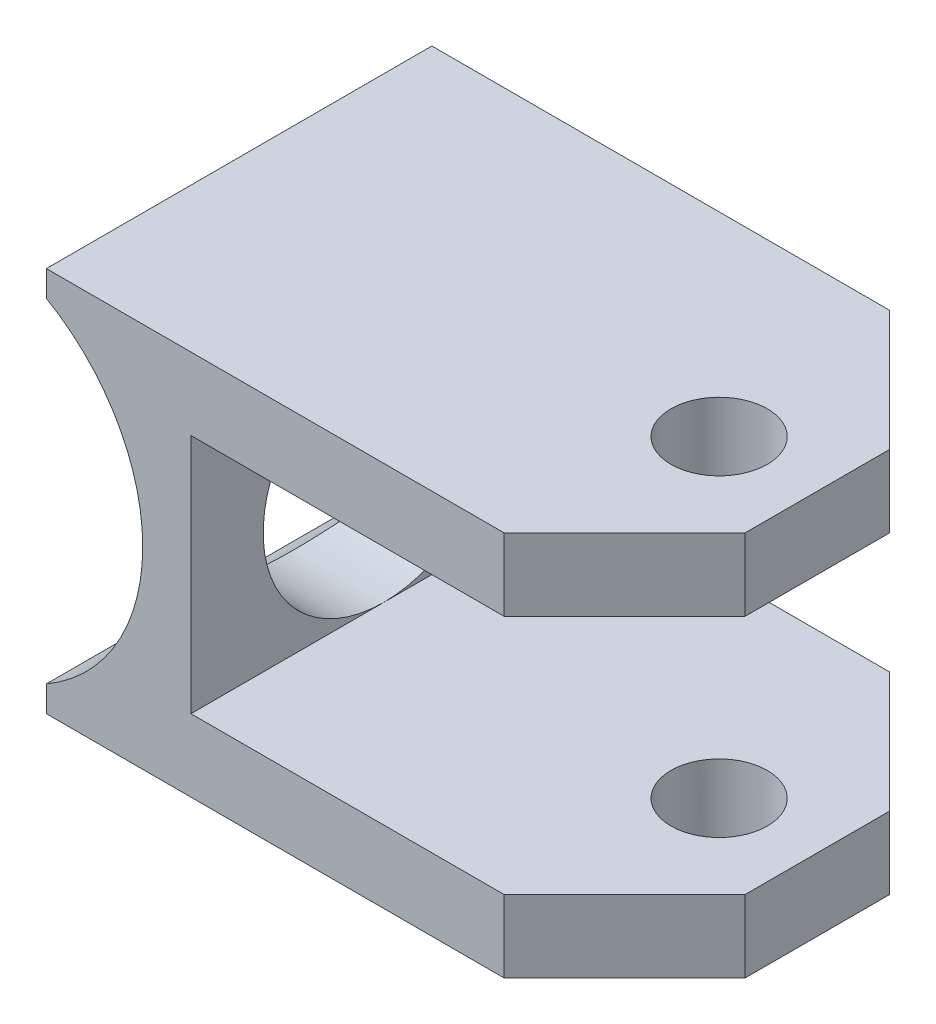
ISO-10303-21;
HEADER;
FILE_DESCRIPTION(('STEP AP214'),'2;1');
FILE_NAME('part.step','',(''),(''),'','','');
FILE_SCHEMA(('AUTOMOTIVE_DESIGN { 1 0 10303 214 1 1 1 1 }'));
ENDSEC;
DATA;
#1=APPLICATION_CONTEXT('core data for automotive mechanical design processes');
#2=APPLICATION_PROTOCOL_DEFINITION('international standard','automotive_design',2000,#1);
#3=PRODUCT_CONTEXT('',#1,'mechanical');
#4=PRODUCT('Part','Part','',(#3));
#5=PRODUCT_RELATED_PRODUCT_CATEGORY('part','',(#4));
#6=PRODUCT_DEFINITION_FORMATION('','',#4);
#7=PRODUCT_DEFINITION_CONTEXT('part definition',#1,'design');
#8=PRODUCT_DEFINITION('design','',#6,#7);
#9=PRODUCT_DEFINITION_SHAPE('','',#8);
#10=(LENGTH_UNIT() NAMED_UNIT(*) SI_UNIT(.MILLI.,.METRE.));
#11=(NAMED_UNIT(*) PLANE_ANGLE_UNIT() SI_UNIT($,.RADIAN.));
#12=(NAMED_UNIT(*) SI_UNIT($,.STERADIAN.) SOLID_ANGLE_UNIT());
#13=UNCERTAINTY_MEASURE_WITH_UNIT(LENGTH_MEASURE(1.E-05),#10,'distance_accuracy_value','');
#14=(GEOMETRIC_REPRESENTATION_CONTEXT(3) GLOBAL_UNCERTAINTY_ASSIGNED_CONTEXT((#13)) GLOBAL_UNIT_ASSIGNED_CONTEXT((#10,
#11,#12)) REPRESENTATION_CONTEXT('',''));
#15=CARTESIAN_POINT('',(0.,0.,0.));
#16=DIRECTION('',(0.,0.,1.));
#17=DIRECTION('',(1.,0.,0.));
#18=AXIS2_PLACEMENT_3D('',#15,#16,#17);
#19=CARTESIAN_POINT('',(15.875,7.9375,25.4));
#20=DIRECTION('',(-1.,0.,0.));
#21=DIRECTION('',(0.,-1.,0.));
#22=AXIS2_PLACEMENT_3D('',#19,#20,#21);
#23=PLANE('',#22);
#24=DIRECTION('',(0.,0.,-1.));
#25=VECTOR('',#24,1.);
#26=CARTESIAN_POINT('',(15.875,-7.9375,25.4));
#27=LINE('',#26,#25);
#28=CARTESIAN_POINT('',(15.875,-7.9375,25.4));
#29=VERTEX_POINT('',#28);
#30=CARTESIAN_POINT('',(15.875,-7.9375,12.7));
#31=VERTEX_POINT('',#30);
#32=EDGE_CURVE('E163',#29,#31,#27,.T.);
#33=ORIENTED_EDGE('',*,*,#32,.T.);
#34=CARTESIAN_POINT('',(15.875,0.,12.7));
#35=DIRECTION('',(1.,0.,0.));
#36=DIRECTION('',(0.,1.,0.));
#37=AXIS2_PLACEMENT_3D('',#34,#35,#36);
#38=CIRCLE('',#37,7.9375);
#39=CARTESIAN_POINT('',(15.875,7.9375,12.7));
#40=VERTEX_POINT('',#39);
#41=EDGE_CURVE('E56',#40,#31,#38,.T.);
#42=ORIENTED_EDGE('',*,*,#41,.F.);
#43=DIRECTION('',(0.,0.,-1.));
#44=VECTOR('',#43,1.);
#45=CARTESIAN_POINT('',(15.875,7.9375,25.4));
#46=LINE('',#45,#44);
#47=CARTESIAN_POINT('',(15.875,7.9375,25.4));
#48=VERTEX_POINT('',#47);
#49=EDGE_CURVE('E160',#48,#40,#46,.T.);
#50=ORIENTED_EDGE('',*,*,#49,.F.);
#51=DIRECTION('',(0.,1.,0.));
#52=VECTOR('',#51,1.);
#53=CARTESIAN_POINT('',(15.875,7.9375,25.4));
#54=LINE('',#53,#52);
#55=EDGE_CURVE('E231',#29,#48,#54,.T.);
#56=ORIENTED_EDGE('',*,*,#55,.F.);
#57=EDGE_LOOP('',(#33,#42,#50,#56));
#58=FACE_BOUND('',#57,.T.);
#59=ADVANCED_FACE('F36',(#58),#23,.F.);
#60=CARTESIAN_POINT('',(44.45,-7.9375,25.4));
#61=DIRECTION('',(0.,-1.,0.));
#62=DIRECTION('',(0.,0.,-1.));
#63=AXIS2_PLACEMENT_3D('',#60,#61,#62);
#64=PLANE('',#63);
#65=CARTESIAN_POINT('',(38.1,-7.9375,12.8217741924015));
#66=DIRECTION('',(0.,-1.,0.));
#67=DIRECTION('',(0.,0.,-1.));
#68=AXIS2_PLACEMENT_3D('',#65,#66,#67);
#69=CIRCLE('',#68,3.175);
#70=CARTESIAN_POINT('',(38.1,-7.9375,9.64677419240149));
#71=VERTEX_POINT('',#70);
#72=EDGE_CURVE('E244',#71,#71,#69,.T.);
#73=ORIENTED_EDGE('',*,*,#72,.T.);
#74=EDGE_LOOP('',(#73));
#75=FACE_BOUND('',#74,.T.);
#76=DIRECTION('',(0.,0.,-1.));
#77=VECTOR('',#76,1.);
#78=CARTESIAN_POINT('',(44.45,-7.9375,25.4));
#79=LINE('',#78,#77);
#80=CARTESIAN_POINT('',(44.45,-7.9375,17.4625));
#81=VERTEX_POINT('',#80);
#82=CARTESIAN_POINT('',(44.45,-7.9375,7.9375));
#83=VERTEX_POINT('',#82);
#84=EDGE_CURVE('E240',#81,#83,#79,.T.);
#85=ORIENTED_EDGE('',*,*,#84,.T.);
#86=DIRECTION('',(0.707106781186549,0.,0.707106781186546));
#87=VECTOR('',#86,1.);
#88=CARTESIAN_POINT('',(44.45,-7.9375,7.9375));
#89=LINE('',#88,#87);
#90=CARTESIAN_POINT('',(36.5125,-7.9375,0.));
#91=VERTEX_POINT('',#90);
#92=EDGE_CURVE('E206',#83,#91,#89,.F.);
#93=ORIENTED_EDGE('',*,*,#92,.T.);
#94=DIRECTION('',(-1.,0.,0.));
#95=VECTOR('',#94,1.);
#96=CARTESIAN_POINT('',(44.45,-7.9375,0.));
#97=LINE('',#96,#95);
#98=CARTESIAN_POINT('',(15.875,-7.9375,0.));
#99=VERTEX_POINT('',#98);
#100=EDGE_CURVE('E241',#91,#99,#97,.T.);
#101=ORIENTED_EDGE('',*,*,#100,.T.);
#102=EDGE_CURVE('E177',#31,#99,#27,.T.);
#103=ORIENTED_EDGE('',*,*,#102,.F.);
#104=ORIENTED_EDGE('',*,*,#32,.F.);
#105=DIRECTION('',(-1.,0.,0.));
#106=VECTOR('',#105,1.);
#107=CARTESIAN_POINT('',(44.45,-7.9375,25.4));
#108=LINE('',#107,#106);
#109=CARTESIAN_POINT('',(36.5125,-7.9375,25.4));
#110=VERTEX_POINT('',#109);
#111=EDGE_CURVE('E259',#110,#29,#108,.T.);
#112=ORIENTED_EDGE('',*,*,#111,.F.);
#113=DIRECTION('',(0.707106781186546,0.,-0.707106781186549));
#114=VECTOR('',#113,1.);
#115=CARTESIAN_POINT('',(36.5125,-7.9375,25.4));
#116=LINE('',#115,#114);
#117=EDGE_CURVE('E204',#110,#81,#116,.T.);
#118=ORIENTED_EDGE('',*,*,#117,.T.);
#119=EDGE_LOOP('',(#85,#93,#101,#103,#104,#112,#118));
#120=FACE_BOUND('',#119,.T.);
#121=ADVANCED_FACE('F319',(#75,#120),#64,.F.);
#122=CARTESIAN_POINT('',(15.875,7.9375,0.));
#123=VERTEX_POINT('',#122);
#124=EDGE_CURVE('E165',#40,#123,#46,.T.);
#125=ORIENTED_EDGE('',*,*,#124,.F.);
#126=EDGE_CURVE('E148',#31,#40,#38,.T.);
#127=ORIENTED_EDGE('',*,*,#126,.F.);
#128=ORIENTED_EDGE('',*,*,#102,.T.);
#129=DIRECTION('',(0.,1.,0.));
#130=VECTOR('',#129,1.);
#131=CARTESIAN_POINT('',(15.875,7.9375,0.));
#132=LINE('',#131,#130);
#133=EDGE_CURVE('E168',#99,#123,#132,.T.);
#134=ORIENTED_EDGE('',*,*,#133,.T.);
#135=EDGE_LOOP('',(#125,#127,#128,#134));
#136=FACE_BOUND('',#135,.T.);
#137=ADVANCED_FACE('F166',(#136),#23,.F.);
#138=CARTESIAN_POINT('',(44.45,7.9375,25.4));
#139=DIRECTION('',(0.,1.,0.));
#140=DIRECTION('',(0.,0.,1.));
#141=AXIS2_PLACEMENT_3D('',#138,#139,#140);
#142=PLANE('',#141);
#143=CARTESIAN_POINT('',(38.1,7.9375,12.8217741924015));
#144=DIRECTION('',(0.,1.,0.));
#145=DIRECTION('',(0.,0.,1.));
#146=AXIS2_PLACEMENT_3D('',#143,#144,#145);
#147=CIRCLE('',#146,3.175);
#148=CARTESIAN_POINT('',(38.1,7.9375,15.9967741924015));
#149=VERTEX_POINT('',#148);
#150=EDGE_CURVE('E355',#149,#149,#147,.T.);
#151=ORIENTED_EDGE('',*,*,#150,.T.);
#152=EDGE_LOOP('',(#151));
#153=FACE_BOUND('',#152,.T.);
#154=DIRECTION('',(1.,0.,0.));
#155=VECTOR('',#154,1.);
#156=CARTESIAN_POINT('',(44.45,7.9375,0.));
#157=LINE('',#156,#155);
#158=CARTESIAN_POINT('',(36.5125,7.9375,0.));
#159=VERTEX_POINT('',#158);
#160=EDGE_CURVE('E246',#123,#159,#157,.T.);
#161=ORIENTED_EDGE('',*,*,#160,.T.);
#162=DIRECTION('',(-0.707106781186549,0.,-0.707106781186546));
#163=VECTOR('',#162,1.);
#164=CARTESIAN_POINT('',(44.45,7.9375,7.9375));
#165=LINE('',#164,#163);
#166=CARTESIAN_POINT('',(44.45,7.9375,7.9375));
#167=VERTEX_POINT('',#166);
#168=EDGE_CURVE('E197',#159,#167,#165,.F.);
#169=ORIENTED_EDGE('',*,*,#168,.T.);
#170=DIRECTION('',(0.,0.,-1.));
#171=VECTOR('',#170,1.);
#172=CARTESIAN_POINT('',(44.45,7.9375,25.4));
#173=LINE('',#172,#171);
#174=CARTESIAN_POINT('',(44.45,7.9375,17.4625));
#175=VERTEX_POINT('',#174);
#176=EDGE_CURVE('E172',#175,#167,#173,.T.);
#177=ORIENTED_EDGE('',*,*,#176,.F.);
#178=DIRECTION('',(-0.707106781186546,0.,0.707106781186549));
#179=VECTOR('',#178,1.);
#180=CARTESIAN_POINT('',(36.5125,7.9375,25.4));
#181=LINE('',#180,#179);
#182=CARTESIAN_POINT('',(36.5125,7.9375,25.4));
#183=VERTEX_POINT('',#182);
#184=EDGE_CURVE('E195',#175,#183,#181,.T.);
#185=ORIENTED_EDGE('',*,*,#184,.T.);
#186=DIRECTION('',(1.,0.,0.));
#187=VECTOR('',#186,1.);
#188=CARTESIAN_POINT('',(44.45,7.9375,25.4));
#189=LINE('',#188,#187);
#190=EDGE_CURVE('E176',#48,#183,#189,.T.);
#191=ORIENTED_EDGE('',*,*,#190,.F.);
#192=ORIENTED_EDGE('',*,*,#49,.T.);
#193=ORIENTED_EDGE('',*,*,#124,.T.);
#194=EDGE_LOOP('',(#161,#169,#177,#185,#191,#192,#193));
#195=FACE_BOUND('',#194,.T.);
#196=ADVANCED_FACE('F174',(#153,#195),#142,.F.);
#197=CARTESIAN_POINT('',(44.45,12.7,25.4));
#198=DIRECTION('',(-1.,0.,0.));
#199=DIRECTION('',(0.,0.,1.));
#200=AXIS2_PLACEMENT_3D('',#197,#198,#199);
#201=PLANE('',#200);
#202=ORIENTED_EDGE('',*,*,#176,.T.);
#203=DIRECTION('',(0.,1.,0.));
#204=VECTOR('',#203,1.);
#205=CARTESIAN_POINT('',(44.45,12.7,7.9375));
#206=LINE('',#205,#204);
#207=CARTESIAN_POINT('',(44.45,12.7,7.9375));
#208=VERTEX_POINT('',#207);
#209=EDGE_CURVE('E184',#167,#208,#206,.T.);
#210=ORIENTED_EDGE('',*,*,#209,.T.);
#211=DIRECTION('',(0.,0.,-1.));
#212=VECTOR('',#211,1.);
#213=CARTESIAN_POINT('',(44.45,12.7,25.4));
#214=LINE('',#213,#212);
#215=CARTESIAN_POINT('',(44.45,12.7,17.4625));
#216=VERTEX_POINT('',#215);
#217=EDGE_CURVE('E274',#216,#208,#214,.T.);
#218=ORIENTED_EDGE('',*,*,#217,.F.);
#219=DIRECTION('',(0.,-1.,0.));
#220=VECTOR('',#219,1.);
#221=CARTESIAN_POINT('',(44.45,7.9375,17.4625));
#222=LINE('',#221,#220);
#223=EDGE_CURVE('E182',#216,#175,#222,.T.);
#224=ORIENTED_EDGE('',*,*,#223,.T.);
#225=EDGE_LOOP('',(#202,#210,#218,#224));
#226=FACE_BOUND('',#225,.T.);
#227=ADVANCED_FACE('F279',(#226),#201,.F.);
#228=CARTESIAN_POINT('',(6.35,12.7,25.4));
#229=DIRECTION('',(0.,-1.,0.));
#230=DIRECTION('',(0.,0.,-1.));
#231=AXIS2_PLACEMENT_3D('',#228,#229,#230);
#232=PLANE('',#231);
#233=CARTESIAN_POINT('',(38.1,12.7,12.8217741924015));
#234=DIRECTION('',(0.,1.,0.));
#235=DIRECTION('',(0.,0.,1.));
#236=AXIS2_PLACEMENT_3D('',#233,#234,#235);
#237=CIRCLE('',#236,3.175);
#238=CARTESIAN_POINT('',(38.1,12.7,15.9967741924015));
#239=VERTEX_POINT('',#238);
#240=EDGE_CURVE('E349',#239,#239,#237,.T.);
#241=ORIENTED_EDGE('',*,*,#240,.F.);
#242=EDGE_LOOP('',(#241));
#243=FACE_BOUND('',#242,.T.);
#244=ORIENTED_EDGE('',*,*,#217,.T.);
#245=DIRECTION('',(0.707106781186549,0.,0.707106781186546));
#246=VECTOR('',#245,1.);
#247=CARTESIAN_POINT('',(44.45,12.7,7.9375));
#248=LINE('',#247,#246);
#249=CARTESIAN_POINT('',(36.5125,12.7,0.));
#250=VERTEX_POINT('',#249);
#251=EDGE_CURVE('E189',#208,#250,#248,.F.);
#252=ORIENTED_EDGE('',*,*,#251,.T.);
#253=DIRECTION('',(-1.,0.,0.));
#254=VECTOR('',#253,1.);
#255=CARTESIAN_POINT('',(6.35,12.7,0.));
#256=LINE('',#255,#254);
#257=CARTESIAN_POINT('',(6.35,12.7,0.));
#258=VERTEX_POINT('',#257);
#259=EDGE_CURVE('E248',#250,#258,#256,.T.);
#260=ORIENTED_EDGE('',*,*,#259,.T.);
#261=DIRECTION('',(0.,0.,-1.));
#262=VECTOR('',#261,1.);
#263=CARTESIAN_POINT('',(6.35,12.7,25.4));
#264=LINE('',#263,#262);
#265=CARTESIAN_POINT('',(6.35,12.7,25.4));
#266=VERTEX_POINT('',#265);
#267=EDGE_CURVE('E225',#266,#258,#264,.T.);
#268=ORIENTED_EDGE('',*,*,#267,.F.);
#269=DIRECTION('',(-1.,0.,0.));
#270=VECTOR('',#269,1.);
#271=CARTESIAN_POINT('',(6.35,12.7,25.4));
#272=LINE('',#271,#270);
#273=CARTESIAN_POINT('',(36.5125,12.7,25.4));
#274=VERTEX_POINT('',#273);
#275=EDGE_CURVE('E216',#274,#266,#272,.T.);
#276=ORIENTED_EDGE('',*,*,#275,.F.);
#277=DIRECTION('',(0.707106781186546,0.,-0.707106781186549));
#278=VECTOR('',#277,1.);
#279=CARTESIAN_POINT('',(36.5125,12.7,25.4));
#280=LINE('',#279,#278);
#281=EDGE_CURVE('E187',#274,#216,#280,.T.);
#282=ORIENTED_EDGE('',*,*,#281,.T.);
#283=EDGE_LOOP('',(#244,#252,#260,#268,#276,#282));
#284=FACE_BOUND('',#283,.T.);
#285=ADVANCED_FACE('F222',(#243,#284),#232,.F.);
#286=CARTESIAN_POINT('',(6.35,12.7,25.4));
#287=DIRECTION('',(1.,0.,0.));
#288=DIRECTION('',(0.,0.,-1.));
#289=AXIS2_PLACEMENT_3D('',#286,#287,#288);
#290=PLANE('',#289);
#291=DIRECTION('',(0.,-1.,0.));
#292=VECTOR('',#291,1.);
#293=CARTESIAN_POINT('',(6.35,12.7,0.));
#294=LINE('',#293,#292);
#295=CARTESIAN_POINT('',(6.35,10.9985226280624,0.));
#296=VERTEX_POINT('',#295);
#297=EDGE_CURVE('E250',#258,#296,#294,.T.);
#298=ORIENTED_EDGE('',*,*,#297,.T.);
#299=DIRECTION('',(0.,0.,-1.));
#300=VECTOR('',#299,1.);
#301=CARTESIAN_POINT('',(6.35,10.9985226280624,25.4));
#302=LINE('',#301,#300);
#303=CARTESIAN_POINT('',(6.35,10.9985226280624,25.4));
#304=VERTEX_POINT('',#303);
#305=EDGE_CURVE('E271',#304,#296,#302,.T.);
#306=ORIENTED_EDGE('',*,*,#305,.F.);
#307=DIRECTION('',(0.,-1.,0.));
#308=VECTOR('',#307,1.);
#309=CARTESIAN_POINT('',(6.35,12.7,25.4));
#310=LINE('',#309,#308);
#311=EDGE_CURVE('E227',#266,#304,#310,.T.);
#312=ORIENTED_EDGE('',*,*,#311,.F.);
#313=ORIENTED_EDGE('',*,*,#267,.T.);
#314=EDGE_LOOP('',(#298,#306,#312,#313));
#315=FACE_BOUND('',#314,.T.);
#316=ADVANCED_FACE('F293',(#315),#290,.F.);
#317=CARTESIAN_POINT('',(0.,0.,25.4));
#318=DIRECTION('',(0.,0.,-1.));
#319=DIRECTION('',(-1.,0.,0.));
#320=AXIS2_PLACEMENT_3D('',#317,#318,#319);
#321=CYLINDRICAL_SURFACE('',#320,12.7);
#322=CARTESIAN_POINT('',(9.91393432245746,7.93749999999999,12.7));
#323=CARTESIAN_POINT('',(9.91393743092308,7.93749807117173,12.8973419473668));
#324=CARTESIAN_POINT('',(9.91985215824847,7.93012603335574,13.0947215209105));
#325=CARTESIAN_POINT('',(9.94324673536641,7.90077104762888,13.4877854127054));
#326=CARTESIAN_POINT('',(9.96073339680289,7.87877949412646,13.6834686636694));
#327=CARTESIAN_POINT('',(10.0065324338063,7.82052925594829,14.0718083760823));
#328=CARTESIAN_POINT('',(10.0348666437677,7.78424179156469,14.2644579115298));
#329=CARTESIAN_POINT('',(10.101195001923,7.69797450385109,14.645043990796));
#330=CARTESIAN_POINT('',(10.1391939786885,7.64798783535172,14.8329781270604));
#331=CARTESIAN_POINT('',(10.2230420608463,7.53553428680958,15.2012730518735));
#332=CARTESIAN_POINT('',(10.2688158617562,7.47318624722427,15.3816875444356));
#333=CARTESIAN_POINT('',(10.3670018650817,7.33637238040691,15.7360566142668));
#334=CARTESIAN_POINT('',(10.4194165927314,7.26190194050868,15.9100087014738));
#335=CARTESIAN_POINT('',(10.5293900056247,7.10150650275365,16.2507695742633));
#336=CARTESIAN_POINT('',(10.5869470535524,7.01558514661686,16.4175806087131));
#337=CARTESIAN_POINT('',(10.7058168021436,6.8328157497932,16.7436961942778));
#338=CARTESIAN_POINT('',(10.7671296214479,6.7359673638515,16.9030005079817));
#339=CARTESIAN_POINT('',(10.9005856580608,6.51810262210699,17.2346122324182));
#340=CARTESIAN_POINT('',(10.9730780959916,6.39558712833621,17.4057956613673));
#341=CARTESIAN_POINT('',(11.1193961406205,6.13767190932958,17.7375632510214));
#342=CARTESIAN_POINT('',(11.1932218447478,6.00227123938997,17.8981466330976));
#343=CARTESIAN_POINT('',(11.3405793525838,5.71898311367739,18.2082916826293));
#344=CARTESIAN_POINT('',(11.4141108977764,5.57108647346249,18.3578450892493));
#345=CARTESIAN_POINT('',(11.5592442814053,5.26334714419427,18.6452007689191));
#346=CARTESIAN_POINT('',(11.6308457432919,5.10350214670036,18.7830007601235));
#347=CARTESIAN_POINT('',(11.7790512355257,4.75231816673879,19.062041829267));
#348=CARTESIAN_POINT('',(11.8552106939563,4.55950961778765,19.2016779504539));
#349=CARTESIAN_POINT('',(12.0010624927184,4.16048061480433,19.4639692392614));
#350=CARTESIAN_POINT('',(12.0707577505083,3.9542662833262,19.586632079773));
#351=CARTESIAN_POINT('',(12.2017054249088,3.52955168731285,19.8136569756096));
#352=CARTESIAN_POINT('',(12.2629618345875,3.31105730280366,19.918027692753));
#353=CARTESIAN_POINT('',(12.3751940579834,2.86318550306455,20.1070996839522));
#354=CARTESIAN_POINT('',(12.4261717410597,2.63381007612534,20.1918045350015));
#355=CARTESIAN_POINT('',(12.5116072321274,2.18985682334513,20.3326287607597));
#356=CARTESIAN_POINT('',(12.5472173985435,1.97614412570738,20.3907783430431));
#357=CARTESIAN_POINT('',(12.6077929385108,1.54315338166047,20.4892142298474));
#358=CARTESIAN_POINT('',(12.632758967362,1.32387567873837,20.5295016340485));
#359=CARTESIAN_POINT('',(12.6712823156172,0.881910980169238,20.5915075654516));
#360=CARTESIAN_POINT('',(12.6848496264323,0.659227144852406,20.6132423549958));
#361=CARTESIAN_POINT('',(12.700189771581,0.212423453759177,20.637809668065));
#362=CARTESIAN_POINT('',(12.7019639634905,-0.011696233754465,20.6406443672919));
#363=CARTESIAN_POINT('',(12.6942296634621,-0.429035223888257,20.6282648350536));
#364=CARTESIAN_POINT('',(12.6862058663109,-0.62235823312776,20.6154257355186));
#365=CARTESIAN_POINT('',(12.6614801835746,-1.00700112464608,20.575736763912));
#366=CARTESIAN_POINT('',(12.6447783901897,-1.19832102818506,20.5488870406977));
#367=CARTESIAN_POINT('',(12.6030772135313,-1.57760898199506,20.4815268240343));
#368=CARTESIAN_POINT('',(12.5780779198634,-1.76557706843963,20.4410164781077));
#369=CARTESIAN_POINT('',(12.5203318918918,-2.13696376055922,20.3468293775869));
#370=CARTESIAN_POINT('',(12.4875848313309,-2.32038217428876,20.2931520685303));
#371=CARTESIAN_POINT('',(12.4149421348142,-2.68203232637647,20.1730841675945));
#372=CARTESIAN_POINT('',(12.3750303286643,-2.86025124976266,20.1066647942266));
#373=CARTESIAN_POINT('',(12.288903070966,-3.21020089927347,19.9618469139278));
#374=CARTESIAN_POINT('',(12.2426855288447,-3.3819294493971,19.8834444331348));
#375=CARTESIAN_POINT('',(12.095872474436,-3.88614684054671,19.6312926139097));
#376=CARTESIAN_POINT('',(11.9870644777299,-4.20791741807511,19.4405148403145));
#377=CARTESIAN_POINT('',(11.7407146973701,-4.8559779367887,18.9926593049406));
#378=CARTESIAN_POINT('',(11.6012821960077,-5.1778470367181,18.7302852986395));
#379=CARTESIAN_POINT('',(11.3153894233701,-5.77597246713827,18.160122153886));
#380=CARTESIAN_POINT('',(11.1689191509646,-6.05216125105313,17.85226701367));
#381=CARTESIAN_POINT('',(10.9442052242841,-6.44525099752128,17.3386711320003));
#382=CARTESIAN_POINT('',(10.863953416429,-6.57924242421982,17.1466373385129));
#383=CARTESIAN_POINT('',(10.7077668255894,-6.83048858697236,16.7501114043343));
#384=CARTESIAN_POINT('',(10.6318328552849,-6.94774017857745,16.5456169332671));
#385=CARTESIAN_POINT('',(10.4871369448416,-7.16428003695993,16.1253190811957));
#386=CARTESIAN_POINT('',(10.4183644230893,-7.26359497075574,15.9095331140881));
#387=CARTESIAN_POINT('',(10.2907680692678,-7.4432684407942,15.4674053699895));
#388=CARTESIAN_POINT('',(10.2319399940845,-7.52363506774175,15.2410681478863));
#389=CARTESIAN_POINT('',(10.1409356021058,-7.64562571774624,14.840082345974));
#390=CARTESIAN_POINT('',(10.1058190992332,-7.69188004525148,14.6674974829339));
#391=CARTESIAN_POINT('',(10.0436676197095,-7.77286000991658,14.3182297843453));
#392=CARTESIAN_POINT('',(10.0166306889123,-7.80758843498593,14.1415479508588));
#393=CARTESIAN_POINT('',(9.97159914754477,-7.86502040955978,13.7852993043909));
#394=CARTESIAN_POINT('',(9.9535943493274,-7.88773750861337,13.6057359786318));
#395=CARTESIAN_POINT('',(9.92725853225642,-7.92085789749513,13.2447592078086));
#396=CARTESIAN_POINT('',(9.91892766668002,-7.93126099221591,13.0633457334762));
#397=CARTESIAN_POINT('',(9.91226303596064,-7.93958886915166,12.699627886823));
#398=CARTESIAN_POINT('',(9.91395234775775,-7.93748484686335,12.5173224248947));
#399=CARTESIAN_POINT('',(9.92731384781059,-7.92076713027602,12.1536582134984));
#400=CARTESIAN_POINT('',(9.93898609289779,-7.90615336476078,11.9722994694258));
#401=CARTESIAN_POINT('',(9.97186350946095,-7.86464458928345,11.6117828822214));
#402=CARTESIAN_POINT('',(9.99307362080675,-7.83774321518591,11.4326262290601));
#403=CARTESIAN_POINT('',(10.0442534502941,-7.77204614469582,11.0777196131951));
#404=CARTESIAN_POINT('',(10.0742267851106,-7.73324553703941,10.9019710890601));
#405=CARTESIAN_POINT('',(10.1413407941711,-7.64501277058946,10.5578759134273));
#406=CARTESIAN_POINT('',(10.1783507843565,-7.59577281991966,10.3894541906629));
#407=CARTESIAN_POINT('',(10.2587766080083,-7.48679406868883,10.0575869903785));
#408=CARTESIAN_POINT('',(10.3021945286435,-7.42705184614786,9.89414315524309));
#409=CARTESIAN_POINT('',(10.4403538304839,-7.23285940874745,9.41220711452345));
#410=CARTESIAN_POINT('',(10.5430357226203,-7.08339933513072,9.10194110865951));
#411=CARTESIAN_POINT('',(10.781510951545,-6.71606056449941,8.4498234680742));
#412=CARTESIAN_POINT('',(10.9198863364876,-6.49057334557518,8.11320473830511));
#413=CARTESIAN_POINT('',(11.1306963245213,-6.11704111107704,7.63774622437057));
#414=CARTESIAN_POINT('',(11.2015652952635,-5.98652858081219,7.48406086270945));
#415=CARTESIAN_POINT('',(11.3429763006025,-5.71405449107206,7.18691398237368));
#416=CARTESIAN_POINT('',(11.4135182725577,-5.57209082661585,7.04345435259447));
#417=CARTESIAN_POINT('',(11.5640372459169,-5.2534636765396,6.74516975727459));
#418=CARTESIAN_POINT('',(11.6437082552696,-5.07489047419139,6.59222444225079));
#419=CARTESIAN_POINT('',(11.7985367210445,-4.70371630182141,6.30199791161703));
#420=CARTESIAN_POINT('',(11.8736958712464,-4.51112065675944,6.16471080018115));
#421=CARTESIAN_POINT('',(12.0175099931568,-4.11269997828182,5.90692310882832));
#422=CARTESIAN_POINT('',(12.0861652819097,-3.9068755905506,5.78642171052195));
#423=CARTESIAN_POINT('',(12.215028128029,-3.48311756629154,5.56353821312848));
#424=CARTESIAN_POINT('',(12.2752367509349,-3.26518546199252,5.46115382816924));
#425=CARTESIAN_POINT('',(12.3821073364553,-2.83199177980674,5.28141588628359));
#426=CARTESIAN_POINT('',(12.4293629720927,-2.61734576396781,5.20293385002475));
#427=CARTESIAN_POINT('',(12.5134440839727,-2.18019278875926,5.06434501873419));
#428=CARTESIAN_POINT('',(12.5502698053864,-1.95768601430726,5.00423779177151));
#429=CARTESIAN_POINT('',(12.6123219175109,-1.50698970812904,4.90345291578128));
#430=CARTESIAN_POINT('',(12.6375616318848,-1.27880702366645,4.86275294671762));
#431=CARTESIAN_POINT('',(12.6756810572711,-0.818749786145594,4.80143183963765));
#432=CARTESIAN_POINT('',(12.688562812949,-0.586875850273308,4.78080738005311));
#433=CARTESIAN_POINT('',(12.7005867596475,-0.156261293647302,4.76155892461821));
#434=CARTESIAN_POINT('',(12.70147806193,0.0423118825154984,4.76013411291166));
#435=CARTESIAN_POINT('',(12.6939644931375,0.438829919383832,4.77215881998338));
#436=CARTESIAN_POINT('',(12.685560050359,0.636774808615952,4.78560765346638));
#437=CARTESIAN_POINT('',(12.6596609571081,1.03049004439692,4.82718699179976));
#438=CARTESIAN_POINT('',(12.6421670478776,1.22626056693495,4.85531629946479));
#439=CARTESIAN_POINT('',(12.598507705164,1.61422143641658,4.92587174223497));
#440=CARTESIAN_POINT('',(12.5723420911155,1.80641170872293,4.96829817504016));
#441=CARTESIAN_POINT('',(12.5129997291544,2.17927146967088,5.06517973090754));
#442=CARTESIAN_POINT('',(12.4801004774043,2.36010874093628,5.11916178651719));
#443=CARTESIAN_POINT('',(12.4074472588691,2.71630413457792,5.23937361310624));
#444=CARTESIAN_POINT('',(12.3676910756804,2.89166046360292,5.30560734476566));
#445=CARTESIAN_POINT('',(12.2821039617717,3.23594956191219,5.4496659460595));
#446=CARTESIAN_POINT('',(12.2362747015826,3.40488408126802,5.52748762890358));
#447=CARTESIAN_POINT('',(12.1393647800458,3.73571812716443,5.69409831573719));
#448=CARTESIAN_POINT('',(12.0882822147684,3.89761507265321,5.78289129836725));
#449=CARTESIAN_POINT('',(11.9174367352839,4.40453137082998,6.08422041738119));
#450=CARTESIAN_POINT('',(11.789125336336,4.73498961253622,6.3168741254543));
#451=CARTESIAN_POINT('',(11.5210034521921,5.35450474789467,6.82679162091428));
#452=CARTESIAN_POINT('',(11.38118007982,5.64351422152492,7.10410574499164));
#453=CARTESIAN_POINT('',(11.1609311335306,6.06245469084998,7.57138443198061));
#454=CARTESIAN_POINT('',(11.0806664160962,6.20757371147303,7.74801049072365));
#455=CARTESIAN_POINT('',(10.9221411305204,6.48244047607236,8.11368961161338));
#456=CARTESIAN_POINT('',(10.8438809280521,6.61218543087358,8.3027449190405));
#457=CARTESIAN_POINT('',(10.6156799834555,6.97705598554874,8.88746806028404));
#458=CARTESIAN_POINT('',(10.4720667600113,7.18827539875168,9.30120253140835));
#459=CARTESIAN_POINT('',(10.2507773072005,7.49932946637276,10.0737985118251));
#460=CARTESIAN_POINT('',(10.1655461083059,7.61344381460759,10.4247206322575));
#461=CARTESIAN_POINT('',(10.0631440576819,7.74765800298494,10.9644717705398));
#462=CARTESIAN_POINT('',(10.0332681346926,7.78621624163261,11.1464271212424));
#463=CARTESIAN_POINT('',(9.98298925565334,7.85058138682066,11.5138311056077));
#464=CARTESIAN_POINT('',(9.96258142541109,7.87639485483383,11.6992778905913));
#465=CARTESIAN_POINT('',(9.93626716627901,7.90954454493815,12.0207163673922));
#466=CARTESIAN_POINT('',(9.9279108380348,7.92001686347467,12.1561965252872));
#467=CARTESIAN_POINT('',(9.91674264691122,7.9339961320438,12.427778389774));
#468=CARTESIAN_POINT('',(9.91393217834371,7.93750133044005,12.5638802440509));
#469=CARTESIAN_POINT('',(9.91393432245746,7.93749999999999,12.7));
#470=B_SPLINE_CURVE_WITH_KNOTS('',3,(#322,#323,#324,#325,#326,#327,#328,#329,#330,#331,#332,
#333,#334,#335,#336,#337,#338,#339,#340,#341,#342,#343,#344,#345,#346,#347,#348,#349,#350,#351,
#352,#353,#354,#355,#356,#357,#358,#359,#360,#361,#362,#363,#364,#365,#366,#367,#368,#369,#370,
#371,#372,#373,#374,#375,#376,#377,#378,#379,#380,#381,#382,#383,#384,#385,#386,#387,#388,#389,
#390,#391,#392,#393,#394,#395,#396,#397,#398,#399,#400,#401,#402,#403,#404,#405,#406,#407,#408,
#409,#410,#411,#412,#413,#414,#415,#416,#417,#418,#419,#420,#421,#422,#423,#424,#425,#426,#427,
#428,#429,#430,#431,#432,#433,#434,#435,#436,#437,#438,#439,#440,#441,#442,#443,#444,#445,#446,
#447,#448,#449,#450,#451,#452,#453,#454,#455,#456,#457,#458,#459,#460,#461,#462,#463,#464,#465,
#466,#467,#468,#469),.UNSPECIFIED.,.T.,.F.,(4,2,2,2,2,2,2,2,2,2,2,2,2,2,2,2,2,2,2,2,2,2,2,2,2,2,
2,2,2,2,2,2,2,2,2,2,2,2,2,2,2,2,2,2,2,2,2,2,2,2,2,2,2,2,2,2,2,2,2,2,2,2,2,2,2,2,2,2,2,2,2,2,2,
4),(0.,0.591868627851358,1.18408596048253,1.77750165380366,2.37121440529117,2.95947423182983,
3.54795842122594,4.13625590039149,4.72457197284976,5.39183974714808,6.05915648133166,
6.72696802742672,7.39490893086401,8.14375547254982,8.89226237916849,9.64041388408815,
10.3884292021125,11.06042681852,11.7323830578222,12.4037496855178,13.0750390268694,
13.6560853409466,14.2371254817675,14.8181593480741,15.3992176859833,15.9816042967208,
16.5641844604029,17.7285465780936,19.0378098157476,20.3489920539132,21.090817692213,
21.8327824939127,22.5736349446533,23.3141704848642,23.8599197831255,24.405536978029,
24.9505373613146,25.4955463796607,26.0418110660364,26.5880788622416,27.134629908943,
27.68140684223,28.2188767470207,28.7565221025905,29.8312827257654,31.1106653030828,
31.7513794571451,32.392211658741,33.1360493525192,33.8796060359229,34.6231264544351,
35.3665529939868,36.0656523145943,36.7647352004268,37.4630121292216,38.1611735058357,
38.7561604440118,39.3511199696233,39.9460309841615,40.5409543869227,41.1150518645325,
41.6893352598014,42.2634610126861,42.8377955814166,44.1046058539166,45.3728540698994,
46.0989299661152,46.8251373865625,48.2753879889853,49.4067352744844,49.9712745352798,
50.5355228468086,50.9436710721342,51.3519218989456),.UNSPECIFIED.);
#471=CARTESIAN_POINT('',(9.91393432245746,7.93749999999999,12.7));
#472=VERTEX_POINT('',#471);
#473=EDGE_CURVE('E40',#472,#472,#470,.T.);
#474=ORIENTED_EDGE('',*,*,#473,.T.);
#475=EDGE_LOOP('',(#474));
#476=FACE_BOUND('',#475,.T.);
#477=CARTESIAN_POINT('',(0.,0.,0.));
#478=DIRECTION('',(0.,0.,-1.));
#479=DIRECTION('',(1.,0.,0.));
#480=AXIS2_PLACEMENT_3D('',#477,#478,#479);
#481=CIRCLE('',#480,12.7);
#482=CARTESIAN_POINT('',(6.34999999999999,-10.9985226280624,0.));
#483=VERTEX_POINT('',#482);
#484=EDGE_CURVE('E252',#296,#483,#481,.T.);
#485=ORIENTED_EDGE('',*,*,#484,.T.);
#486=DIRECTION('',(0.,0.,-1.));
#487=VECTOR('',#486,1.);
#488=CARTESIAN_POINT('',(6.34999999999999,-10.9985226280624,25.4));
#489=LINE('',#488,#487);
#490=CARTESIAN_POINT('',(6.34999999999999,-10.9985226280624,25.4));
#491=VERTEX_POINT('',#490);
#492=EDGE_CURVE('E268',#491,#483,#489,.T.);
#493=ORIENTED_EDGE('',*,*,#492,.F.);
#494=CARTESIAN_POINT('',(0.,0.,25.4));
#495=DIRECTION('',(0.,0.,-1.));
#496=DIRECTION('',(1.,0.,0.));
#497=AXIS2_PLACEMENT_3D('',#494,#495,#496);
#498=CIRCLE('',#497,12.7);
#499=EDGE_CURVE('E229',#304,#491,#498,.T.);
#500=ORIENTED_EDGE('',*,*,#499,.F.);
#501=ORIENTED_EDGE('',*,*,#305,.T.);
#502=EDGE_LOOP('',(#485,#493,#500,#501));
#503=FACE_BOUND('',#502,.T.);
#504=ADVANCED_FACE('F296',(#476,#503),#321,.F.);
#505=CARTESIAN_POINT('',(6.34999999999999,-12.7,25.4));
#506=DIRECTION('',(1.,0.,0.));
#507=DIRECTION('',(0.,0.,-1.));
#508=AXIS2_PLACEMENT_3D('',#505,#506,#507);
#509=PLANE('',#508);
#510=DIRECTION('',(0.,-1.,0.));
#511=VECTOR('',#510,1.);
#512=CARTESIAN_POINT('',(6.34999999999999,-12.7,0.));
#513=LINE('',#512,#511);
#514=CARTESIAN_POINT('',(6.34999999999999,-12.7,0.));
#515=VERTEX_POINT('',#514);
#516=EDGE_CURVE('E254',#483,#515,#513,.T.);
#517=ORIENTED_EDGE('',*,*,#516,.T.);
#518=DIRECTION('',(0.,0.,-1.));
#519=VECTOR('',#518,1.);
#520=CARTESIAN_POINT('',(6.34999999999999,-12.7,25.4));
#521=LINE('',#520,#519);
#522=CARTESIAN_POINT('',(6.34999999999999,-12.7,25.4));
#523=VERTEX_POINT('',#522);
#524=EDGE_CURVE('E265',#523,#515,#521,.T.);
#525=ORIENTED_EDGE('',*,*,#524,.F.);
#526=DIRECTION('',(0.,-1.,0.));
#527=VECTOR('',#526,1.);
#528=CARTESIAN_POINT('',(6.34999999999999,-12.7,25.4));
#529=LINE('',#528,#527);
#530=EDGE_CURVE('E236',#491,#523,#529,.T.);
#531=ORIENTED_EDGE('',*,*,#530,.F.);
#532=ORIENTED_EDGE('',*,*,#492,.T.);
#533=EDGE_LOOP('',(#517,#525,#531,#532));
#534=FACE_BOUND('',#533,.T.);
#535=ADVANCED_FACE('F302',(#534),#509,.F.);
#536=CARTESIAN_POINT('',(6.34999999999999,-12.7,25.4));
#537=DIRECTION('',(0.,1.,0.));
#538=DIRECTION('',(0.,0.,1.));
#539=AXIS2_PLACEMENT_3D('',#536,#537,#538);
#540=PLANE('',#539);
#541=CARTESIAN_POINT('',(38.1,-12.7,12.8217741924015));
#542=DIRECTION('',(0.,1.,0.));
#543=DIRECTION('',(0.,0.,1.));
#544=AXIS2_PLACEMENT_3D('',#541,#542,#543);
#545=CIRCLE('',#544,3.175);
#546=CARTESIAN_POINT('',(38.1,-12.7,15.9967741924015));
#547=VERTEX_POINT('',#546);
#548=EDGE_CURVE('E351',#547,#547,#545,.T.);
#549=ORIENTED_EDGE('',*,*,#548,.T.);
#550=EDGE_LOOP('',(#549));
#551=FACE_BOUND('',#550,.T.);
#552=DIRECTION('',(1.,0.,0.));
#553=VECTOR('',#552,1.);
#554=CARTESIAN_POINT('',(6.34999999999999,-12.7,0.));
#555=LINE('',#554,#553);
#556=CARTESIAN_POINT('',(36.5125,-12.7,0.));
#557=VERTEX_POINT('',#556);
#558=EDGE_CURVE('E256',#515,#557,#555,.T.);
#559=ORIENTED_EDGE('',*,*,#558,.T.);
#560=DIRECTION('',(-0.707106781186549,0.,-0.707106781186546));
#561=VECTOR('',#560,1.);
#562=CARTESIAN_POINT('',(44.45,-12.7,7.9375));
#563=LINE('',#562,#561);
#564=CARTESIAN_POINT('',(44.45,-12.7,7.9375));
#565=VERTEX_POINT('',#564);
#566=EDGE_CURVE('E209',#557,#565,#563,.F.);
#567=ORIENTED_EDGE('',*,*,#566,.T.);
#568=DIRECTION('',(0.,0.,-1.));
#569=VECTOR('',#568,1.);
#570=CARTESIAN_POINT('',(44.45,-12.7,25.4));
#571=LINE('',#570,#569);
#572=CARTESIAN_POINT('',(44.45,-12.7,17.4625));
#573=VERTEX_POINT('',#572);
#574=EDGE_CURVE('E262',#573,#565,#571,.T.);
#575=ORIENTED_EDGE('',*,*,#574,.F.);
#576=DIRECTION('',(-0.707106781186546,0.,0.707106781186549));
#577=VECTOR('',#576,1.);
#578=CARTESIAN_POINT('',(36.5125,-12.7,25.4));
#579=LINE('',#578,#577);
#580=CARTESIAN_POINT('',(36.5125,-12.7,25.4));
#581=VERTEX_POINT('',#580);
#582=EDGE_CURVE('E64',#573,#581,#579,.T.);
#583=ORIENTED_EDGE('',*,*,#582,.T.);
#584=DIRECTION('',(1.,0.,0.));
#585=VECTOR('',#584,1.);
#586=CARTESIAN_POINT('',(6.34999999999999,-12.7,25.4));
#587=LINE('',#586,#585);
#588=EDGE_CURVE('E238',#523,#581,#587,.T.);
#589=ORIENTED_EDGE('',*,*,#588,.F.);
#590=ORIENTED_EDGE('',*,*,#524,.T.);
#591=EDGE_LOOP('',(#559,#567,#575,#583,#589,#590));
#592=FACE_BOUND('',#591,.T.);
#593=ADVANCED_FACE('F304',(#551,#592),#540,.F.);
#594=CARTESIAN_POINT('',(44.45,-12.7,25.4));
#595=DIRECTION('',(-1.,0.,0.));
#596=DIRECTION('',(0.,0.,1.));
#597=AXIS2_PLACEMENT_3D('',#594,#595,#596);
#598=PLANE('',#597);
#599=ORIENTED_EDGE('',*,*,#574,.T.);
#600=DIRECTION('',(0.,1.,0.));
#601=VECTOR('',#600,1.);
#602=CARTESIAN_POINT('',(44.45,-12.7,7.9375));
#603=LINE('',#602,#601);
#604=EDGE_CURVE('E201',#565,#83,#603,.T.);
#605=ORIENTED_EDGE('',*,*,#604,.T.);
#606=ORIENTED_EDGE('',*,*,#84,.F.);
#607=DIRECTION('',(0.,-1.,0.));
#608=VECTOR('',#607,1.);
#609=CARTESIAN_POINT('',(44.45,-12.7,17.4625));
#610=LINE('',#609,#608);
#611=EDGE_CURVE('E199',#81,#573,#610,.T.);
#612=ORIENTED_EDGE('',*,*,#611,.T.);
#613=EDGE_LOOP('',(#599,#605,#606,#612));
#614=FACE_BOUND('',#613,.T.);
#615=ADVANCED_FACE('F307',(#614),#598,.F.);
#616=CARTESIAN_POINT('',(0.,0.,25.4));
#617=DIRECTION('',(0.,0.,1.));
#618=DIRECTION('',(1.,0.,0.));
#619=AXIS2_PLACEMENT_3D('',#616,#617,#618);
#620=PLANE('',#619);
#621=ORIENTED_EDGE('',*,*,#588,.T.);
#622=DIRECTION('',(0.,1.,0.));
#623=VECTOR('',#622,1.);
#624=CARTESIAN_POINT('',(36.5125,-7.9375,25.4));
#625=LINE('',#624,#623);
#626=EDGE_CURVE('E11',#581,#110,#625,.T.);
#627=ORIENTED_EDGE('',*,*,#626,.T.);
#628=ORIENTED_EDGE('',*,*,#111,.T.);
#629=ORIENTED_EDGE('',*,*,#55,.T.);
#630=ORIENTED_EDGE('',*,*,#190,.T.);
#631=DIRECTION('',(0.,1.,0.));
#632=VECTOR('',#631,1.);
#633=CARTESIAN_POINT('',(36.5125,12.7,25.4));
#634=LINE('',#633,#632);
#635=EDGE_CURVE('E50',#183,#274,#634,.T.);
#636=ORIENTED_EDGE('',*,*,#635,.T.);
#637=ORIENTED_EDGE('',*,*,#275,.T.);
#638=ORIENTED_EDGE('',*,*,#311,.T.);
#639=ORIENTED_EDGE('',*,*,#499,.T.);
#640=ORIENTED_EDGE('',*,*,#530,.T.);
#641=EDGE_LOOP('',(#621,#627,#628,#629,#630,#636,#637,#638,#639,#640));
#642=FACE_BOUND('',#641,.T.);
#643=ADVANCED_FACE('F215',(#642),#620,.T.);
#644=CARTESIAN_POINT('',(0.,0.,0.));
#645=DIRECTION('',(0.,0.,1.));
#646=DIRECTION('',(1.,0.,0.));
#647=AXIS2_PLACEMENT_3D('',#644,#645,#646);
#648=PLANE('',#647);
#649=ORIENTED_EDGE('',*,*,#259,.F.);
#650=DIRECTION('',(0.,-1.,0.));
#651=VECTOR('',#650,1.);
#652=CARTESIAN_POINT('',(36.5125,0.,0.));
#653=LINE('',#652,#651);
#654=EDGE_CURVE('E193',#250,#159,#653,.T.);
#655=ORIENTED_EDGE('',*,*,#654,.T.);
#656=ORIENTED_EDGE('',*,*,#160,.F.);
#657=ORIENTED_EDGE('',*,*,#133,.F.);
#658=ORIENTED_EDGE('',*,*,#100,.F.);
#659=DIRECTION('',(0.,-1.,0.));
#660=VECTOR('',#659,1.);
#661=CARTESIAN_POINT('',(36.5125,0.,0.));
#662=LINE('',#661,#660);
#663=EDGE_CURVE('E191',#91,#557,#662,.T.);
#664=ORIENTED_EDGE('',*,*,#663,.T.);
#665=ORIENTED_EDGE('',*,*,#558,.F.);
#666=ORIENTED_EDGE('',*,*,#516,.F.);
#667=ORIENTED_EDGE('',*,*,#484,.F.);
#668=ORIENTED_EDGE('',*,*,#297,.F.);
#669=EDGE_LOOP('',(#649,#655,#656,#657,#658,#664,#665,#666,#667,#668));
#670=FACE_BOUND('',#669,.T.);
#671=ADVANCED_FACE('F288',(#670),#648,.F.);
#672=CARTESIAN_POINT('',(38.1,12.7,12.8217741924015));
#673=DIRECTION('',(0.,1.,0.));
#674=DIRECTION('',(0.,0.,1.));
#675=AXIS2_PLACEMENT_3D('',#672,#673,#674);
#676=CYLINDRICAL_SURFACE('',#675,3.175);
#677=ORIENTED_EDGE('',*,*,#240,.T.);
#678=EDGE_LOOP('',(#677));
#679=FACE_BOUND('',#678,.T.);
#680=ORIENTED_EDGE('',*,*,#150,.F.);
#681=EDGE_LOOP('',(#680));
#682=FACE_BOUND('',#681,.T.);
#683=ADVANCED_FACE('F384',(#679,#682),#676,.F.);
#684=ORIENTED_EDGE('',*,*,#548,.F.);
#685=EDGE_LOOP('',(#684));
#686=FACE_BOUND('',#685,.T.);
#687=ORIENTED_EDGE('',*,*,#72,.F.);
#688=EDGE_LOOP('',(#687));
#689=FACE_BOUND('',#688,.T.);
#690=ADVANCED_FACE('F380',(#686,#689),#676,.F.);
#691=CARTESIAN_POINT('',(44.45,12.7,7.9375));
#692=DIRECTION('',(-0.707106781186546,0.,0.707106781186549));
#693=DIRECTION('',(0.,1.,0.));
#694=AXIS2_PLACEMENT_3D('',#691,#692,#693);
#695=PLANE('',#694);
#696=ORIENTED_EDGE('',*,*,#168,.F.);
#697=ORIENTED_EDGE('',*,*,#654,.F.);
#698=ORIENTED_EDGE('',*,*,#251,.F.);
#699=ORIENTED_EDGE('',*,*,#209,.F.);
#700=EDGE_LOOP('',(#696,#697,#698,#699));
#701=FACE_BOUND('',#700,.T.);
#702=ADVANCED_FACE('F283',(#701),#695,.F.);
#703=CARTESIAN_POINT('',(44.45,-12.7,7.9375));
#704=DIRECTION('',(-0.707106781186546,0.,0.707106781186549));
#705=DIRECTION('',(0.,1.,0.));
#706=AXIS2_PLACEMENT_3D('',#703,#704,#705);
#707=PLANE('',#706);
#708=ORIENTED_EDGE('',*,*,#566,.F.);
#709=ORIENTED_EDGE('',*,*,#663,.F.);
#710=ORIENTED_EDGE('',*,*,#92,.F.);
#711=ORIENTED_EDGE('',*,*,#604,.F.);
#712=EDGE_LOOP('',(#708,#709,#710,#711));
#713=FACE_BOUND('',#712,.T.);
#714=ADVANCED_FACE('F366',(#713),#707,.F.);
#715=CARTESIAN_POINT('',(36.5125,0.,25.4));
#716=DIRECTION('',(0.707106781186549,0.,0.707106781186546));
#717=DIRECTION('',(0.,-1.,0.));
#718=AXIS2_PLACEMENT_3D('',#715,#716,#717);
#719=PLANE('',#718);
#720=ORIENTED_EDGE('',*,*,#582,.F.);
#721=ORIENTED_EDGE('',*,*,#611,.F.);
#722=ORIENTED_EDGE('',*,*,#117,.F.);
#723=ORIENTED_EDGE('',*,*,#626,.F.);
#724=EDGE_LOOP('',(#720,#721,#722,#723));
#725=FACE_BOUND('',#724,.T.);
#726=ADVANCED_FACE('F371',(#725),#719,.T.);
#727=CARTESIAN_POINT('',(36.5125,0.,25.4));
#728=DIRECTION('',(0.707106781186549,0.,0.707106781186546));
#729=DIRECTION('',(0.,-1.,0.));
#730=AXIS2_PLACEMENT_3D('',#727,#728,#729);
#731=PLANE('',#730);
#732=ORIENTED_EDGE('',*,*,#184,.F.);
#733=ORIENTED_EDGE('',*,*,#223,.F.);
#734=ORIENTED_EDGE('',*,*,#281,.F.);
#735=ORIENTED_EDGE('',*,*,#635,.F.);
#736=EDGE_LOOP('',(#732,#733,#734,#735));
#737=FACE_BOUND('',#736,.T.);
#738=ADVANCED_FACE('F38',(#737),#731,.T.);
#739=CARTESIAN_POINT('',(6.34999999999998,0.,12.7));
#740=DIRECTION('',(1.,0.,0.));
#741=DIRECTION('',(0.,1.,0.));
#742=AXIS2_PLACEMENT_3D('',#739,#740,#741);
#743=CYLINDRICAL_SURFACE('',#742,7.9375);
#744=ORIENTED_EDGE('',*,*,#41,.T.);
#745=ORIENTED_EDGE('',*,*,#126,.T.);
#746=EDGE_LOOP('',(#744,#745));
#747=FACE_BOUND('',#746,.T.);
#748=ORIENTED_EDGE('',*,*,#473,.F.);
#749=EDGE_LOOP('',(#748));
#750=FACE_BOUND('',#749,.T.);
#751=ADVANCED_FACE('F149',(#747,#750),#743,.F.);
#752=CLOSED_SHELL('',(#59,#121,#137,#196,#227,#285,#316,#504,#535,#593,#615,#643,#671,#683,#690,
#702,#714,#726,#738,#751));
#753=MANIFOLD_SOLID_BREP('B2',#752);
#754=ADVANCED_BREP_SHAPE_REPRESENTATION('',(#18,#753),#14);
#755=SHAPE_DEFINITION_REPRESENTATION(#9,#754);
ENDSEC;
END-ISO-10303-21;
